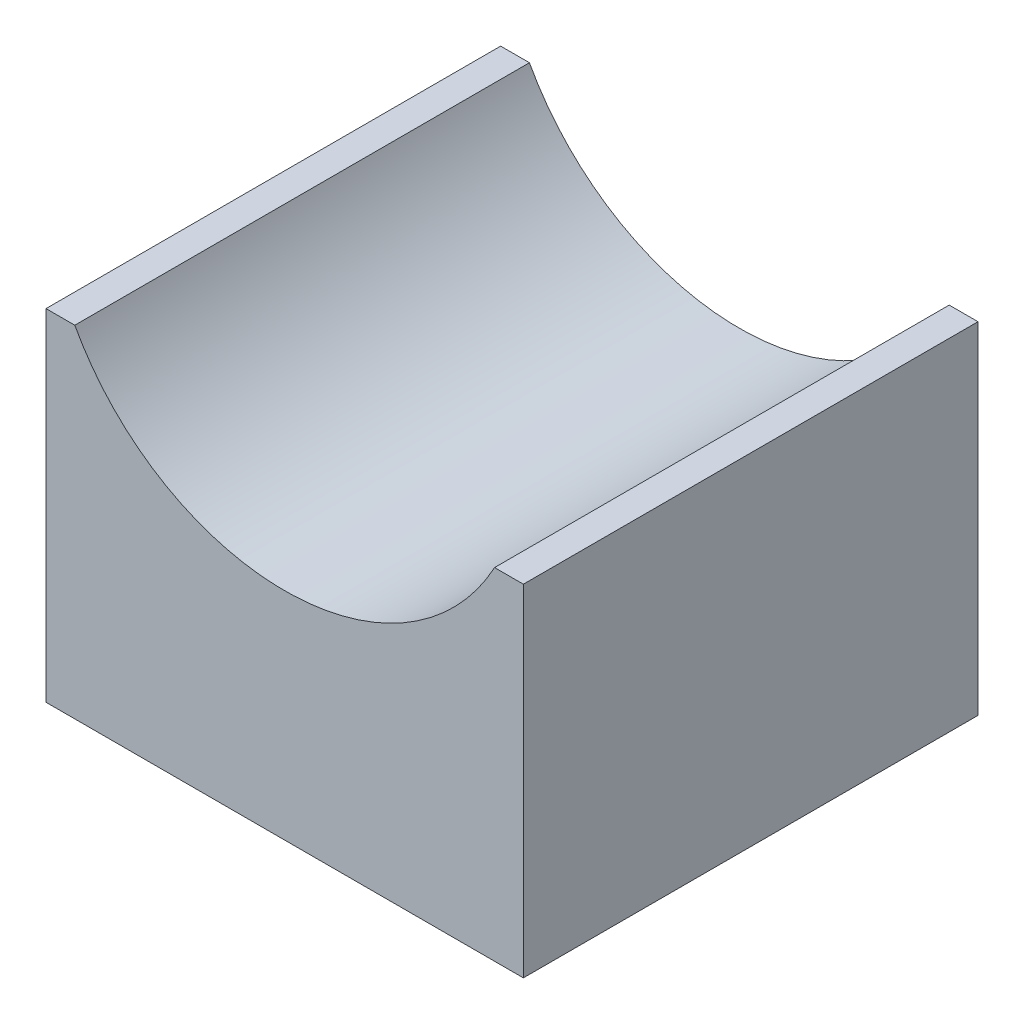
ISO-10303-21;
HEADER;
FILE_DESCRIPTION(('STEP AP214'),'2;1');
FILE_NAME('part.step','',(''),(''),'','','');
FILE_SCHEMA(('AUTOMOTIVE_DESIGN { 1 0 10303 214 1 1 1 1 }'));
ENDSEC;
DATA;
#1=APPLICATION_CONTEXT('core data for automotive mechanical design processes');
#2=APPLICATION_PROTOCOL_DEFINITION('international standard','automotive_design',2000,#1);
#3=PRODUCT_CONTEXT('',#1,'mechanical');
#4=PRODUCT('Part','Part','',(#3));
#5=PRODUCT_RELATED_PRODUCT_CATEGORY('part','',(#4));
#6=PRODUCT_DEFINITION_FORMATION('','',#4);
#7=PRODUCT_DEFINITION_CONTEXT('part definition',#1,'design');
#8=PRODUCT_DEFINITION('design','',#6,#7);
#9=PRODUCT_DEFINITION_SHAPE('','',#8);
#10=(LENGTH_UNIT() NAMED_UNIT(*) SI_UNIT(.MILLI.,.METRE.));
#11=(NAMED_UNIT(*) PLANE_ANGLE_UNIT() SI_UNIT($,.RADIAN.));
#12=(NAMED_UNIT(*) SI_UNIT($,.STERADIAN.) SOLID_ANGLE_UNIT());
#13=UNCERTAINTY_MEASURE_WITH_UNIT(LENGTH_MEASURE(1.E-05),#10,'distance_accuracy_value','');
#14=(GEOMETRIC_REPRESENTATION_CONTEXT(3) GLOBAL_UNCERTAINTY_ASSIGNED_CONTEXT((#13)) GLOBAL_UNIT_ASSIGNED_CONTEXT((#10,
#11,#12)) REPRESENTATION_CONTEXT('',''));
#15=CARTESIAN_POINT('',(0.,0.,0.));
#16=DIRECTION('',(0.,0.,1.));
#17=DIRECTION('',(1.,0.,0.));
#18=AXIS2_PLACEMENT_3D('',#15,#16,#17);
#19=CARTESIAN_POINT('',(0.,20.,10.));
#20=DIRECTION('',(0.,0.,-1.));
#21=DIRECTION('',(-1.,0.,0.));
#22=AXIS2_PLACEMENT_3D('',#19,#20,#21);
#23=CYLINDRICAL_SURFACE('',#22,10.5);
#24=CARTESIAN_POINT('',(0.,20.,-10.));
#25=DIRECTION('',(0.,0.,-1.));
#26=DIRECTION('',(1.,0.,0.));
#27=AXIS2_PLACEMENT_3D('',#24,#25,#26);
#28=CIRCLE('',#27,10.5);
#29=CARTESIAN_POINT('',(9.23309265630969,15.,-10.));
#30=VERTEX_POINT('',#29);
#31=CARTESIAN_POINT('',(-9.23309265630969,15.,-10.));
#32=VERTEX_POINT('',#31);
#33=EDGE_CURVE('E122',#30,#32,#28,.T.);
#34=ORIENTED_EDGE('',*,*,#33,.T.);
#35=DIRECTION('',(0.,0.,-1.));
#36=VECTOR('',#35,1.);
#37=CARTESIAN_POINT('',(-9.23309265630969,15.,10.));
#38=LINE('',#37,#36);
#39=CARTESIAN_POINT('',(-9.23309265630969,15.,10.));
#40=VERTEX_POINT('',#39);
#41=EDGE_CURVE('E11',#40,#32,#38,.T.);
#42=ORIENTED_EDGE('',*,*,#41,.F.);
#43=CARTESIAN_POINT('',(0.,20.,10.));
#44=DIRECTION('',(0.,0.,-1.));
#45=DIRECTION('',(1.,0.,0.));
#46=AXIS2_PLACEMENT_3D('',#43,#44,#45);
#47=CIRCLE('',#46,10.5);
#48=CARTESIAN_POINT('',(9.23309265630969,15.,10.));
#49=VERTEX_POINT('',#48);
#50=EDGE_CURVE('E132',#49,#40,#47,.T.);
#51=ORIENTED_EDGE('',*,*,#50,.F.);
#52=DIRECTION('',(0.,0.,-1.));
#53=VECTOR('',#52,1.);
#54=CARTESIAN_POINT('',(9.23309265630969,15.,10.));
#55=LINE('',#54,#53);
#56=EDGE_CURVE('E118',#49,#30,#55,.T.);
#57=ORIENTED_EDGE('',*,*,#56,.T.);
#58=EDGE_LOOP('',(#34,#42,#51,#57));
#59=FACE_BOUND('',#58,.T.);
#60=ADVANCED_FACE('F38',(#59),#23,.F.);
#61=CARTESIAN_POINT('',(-10.5,15.,10.));
#62=DIRECTION('',(0.,-1.,0.));
#63=DIRECTION('',(0.,0.,-1.));
#64=AXIS2_PLACEMENT_3D('',#61,#62,#63);
#65=PLANE('',#64);
#66=DIRECTION('',(-1.,0.,0.));
#67=VECTOR('',#66,1.);
#68=CARTESIAN_POINT('',(-10.5,15.,-10.));
#69=LINE('',#68,#67);
#70=CARTESIAN_POINT('',(-10.5,15.,-10.));
#71=VERTEX_POINT('',#70);
#72=EDGE_CURVE('E125',#32,#71,#69,.T.);
#73=ORIENTED_EDGE('',*,*,#72,.T.);
#74=DIRECTION('',(0.,0.,-1.));
#75=VECTOR('',#74,1.);
#76=CARTESIAN_POINT('',(-10.5,15.,10.));
#77=LINE('',#76,#75);
#78=CARTESIAN_POINT('',(-10.5,15.,10.));
#79=VERTEX_POINT('',#78);
#80=EDGE_CURVE('E46',#79,#71,#77,.T.);
#81=ORIENTED_EDGE('',*,*,#80,.F.);
#82=DIRECTION('',(-1.,0.,0.));
#83=VECTOR('',#82,1.);
#84=CARTESIAN_POINT('',(-10.5,15.,10.));
#85=LINE('',#84,#83);
#86=EDGE_CURVE('E91',#40,#79,#85,.T.);
#87=ORIENTED_EDGE('',*,*,#86,.F.);
#88=ORIENTED_EDGE('',*,*,#41,.T.);
#89=EDGE_LOOP('',(#73,#81,#87,#88));
#90=FACE_BOUND('',#89,.T.);
#91=ADVANCED_FACE('F156',(#90),#65,.F.);
#92=CARTESIAN_POINT('',(-10.5,15.,10.));
#93=DIRECTION('',(1.,0.,0.));
#94=DIRECTION('',(0.,0.,-1.));
#95=AXIS2_PLACEMENT_3D('',#92,#93,#94);
#96=PLANE('',#95);
#97=DIRECTION('',(0.,-1.,0.));
#98=VECTOR('',#97,1.);
#99=CARTESIAN_POINT('',(-10.5,15.,-10.));
#100=LINE('',#99,#98);
#101=CARTESIAN_POINT('',(-10.5,0.,-10.));
#102=VERTEX_POINT('',#101);
#103=EDGE_CURVE('E127',#71,#102,#100,.T.);
#104=ORIENTED_EDGE('',*,*,#103,.T.);
#105=DIRECTION('',(0.,0.,-1.));
#106=VECTOR('',#105,1.);
#107=CARTESIAN_POINT('',(-10.5,0.,10.));
#108=LINE('',#107,#106);
#109=CARTESIAN_POINT('',(-10.5,0.,10.));
#110=VERTEX_POINT('',#109);
#111=EDGE_CURVE('E113',#110,#102,#108,.T.);
#112=ORIENTED_EDGE('',*,*,#111,.F.);
#113=DIRECTION('',(0.,-1.,0.));
#114=VECTOR('',#113,1.);
#115=CARTESIAN_POINT('',(-10.5,15.,10.));
#116=LINE('',#115,#114);
#117=EDGE_CURVE('E104',#79,#110,#116,.T.);
#118=ORIENTED_EDGE('',*,*,#117,.F.);
#119=ORIENTED_EDGE('',*,*,#80,.T.);
#120=EDGE_LOOP('',(#104,#112,#118,#119));
#121=FACE_BOUND('',#120,.T.);
#122=ADVANCED_FACE('F138',(#121),#96,.F.);
#123=CARTESIAN_POINT('',(-10.5,0.,10.));
#124=DIRECTION('',(0.,1.,0.));
#125=DIRECTION('',(0.,0.,1.));
#126=AXIS2_PLACEMENT_3D('',#123,#124,#125);
#127=PLANE('',#126);
#128=DIRECTION('',(1.,0.,0.));
#129=VECTOR('',#128,1.);
#130=CARTESIAN_POINT('',(-10.5,0.,-10.));
#131=LINE('',#130,#129);
#132=CARTESIAN_POINT('',(10.5,0.,-10.));
#133=VERTEX_POINT('',#132);
#134=EDGE_CURVE('E112',#102,#133,#131,.T.);
#135=ORIENTED_EDGE('',*,*,#134,.T.);
#136=DIRECTION('',(0.,0.,-1.));
#137=VECTOR('',#136,1.);
#138=CARTESIAN_POINT('',(10.5,0.,10.));
#139=LINE('',#138,#137);
#140=CARTESIAN_POINT('',(10.5,0.,10.));
#141=VERTEX_POINT('',#140);
#142=EDGE_CURVE('E109',#141,#133,#139,.T.);
#143=ORIENTED_EDGE('',*,*,#142,.F.);
#144=DIRECTION('',(1.,0.,0.));
#145=VECTOR('',#144,1.);
#146=CARTESIAN_POINT('',(-10.5,0.,10.));
#147=LINE('',#146,#145);
#148=EDGE_CURVE('E98',#110,#141,#147,.T.);
#149=ORIENTED_EDGE('',*,*,#148,.F.);
#150=ORIENTED_EDGE('',*,*,#111,.T.);
#151=EDGE_LOOP('',(#135,#143,#149,#150));
#152=FACE_BOUND('',#151,.T.);
#153=ADVANCED_FACE('F110',(#152),#127,.F.);
#154=CARTESIAN_POINT('',(10.5,0.,10.));
#155=DIRECTION('',(-1.,0.,0.));
#156=DIRECTION('',(0.,-1.,0.));
#157=AXIS2_PLACEMENT_3D('',#154,#155,#156);
#158=PLANE('',#157);
#159=DIRECTION('',(0.,1.,0.));
#160=VECTOR('',#159,1.);
#161=CARTESIAN_POINT('',(10.5,0.,-10.));
#162=LINE('',#161,#160);
#163=CARTESIAN_POINT('',(10.5,15.,-10.));
#164=VERTEX_POINT('',#163);
#165=EDGE_CURVE('E77',#133,#164,#162,.T.);
#166=ORIENTED_EDGE('',*,*,#165,.T.);
#167=DIRECTION('',(0.,0.,-1.));
#168=VECTOR('',#167,1.);
#169=CARTESIAN_POINT('',(10.5,15.,10.));
#170=LINE('',#169,#168);
#171=CARTESIAN_POINT('',(10.5,15.,10.));
#172=VERTEX_POINT('',#171);
#173=EDGE_CURVE('E114',#172,#164,#170,.T.);
#174=ORIENTED_EDGE('',*,*,#173,.F.);
#175=DIRECTION('',(0.,1.,0.));
#176=VECTOR('',#175,1.);
#177=CARTESIAN_POINT('',(10.5,0.,10.));
#178=LINE('',#177,#176);
#179=EDGE_CURVE('E102',#141,#172,#178,.T.);
#180=ORIENTED_EDGE('',*,*,#179,.F.);
#181=ORIENTED_EDGE('',*,*,#142,.T.);
#182=EDGE_LOOP('',(#166,#174,#180,#181));
#183=FACE_BOUND('',#182,.T.);
#184=ADVANCED_FACE('F116',(#183),#158,.F.);
#185=CARTESIAN_POINT('',(9.23309265630969,15.,10.));
#186=DIRECTION('',(0.,-1.,0.));
#187=DIRECTION('',(0.,0.,-1.));
#188=AXIS2_PLACEMENT_3D('',#185,#186,#187);
#189=PLANE('',#188);
#190=DIRECTION('',(-1.,0.,0.));
#191=VECTOR('',#190,1.);
#192=CARTESIAN_POINT('',(9.23309265630969,15.,-10.));
#193=LINE('',#192,#191);
#194=EDGE_CURVE('E83',#164,#30,#193,.T.);
#195=ORIENTED_EDGE('',*,*,#194,.T.);
#196=ORIENTED_EDGE('',*,*,#56,.F.);
#197=DIRECTION('',(-1.,0.,0.));
#198=VECTOR('',#197,1.);
#199=CARTESIAN_POINT('',(9.23309265630969,15.,10.));
#200=LINE('',#199,#198);
#201=EDGE_CURVE('E54',#172,#49,#200,.T.);
#202=ORIENTED_EDGE('',*,*,#201,.F.);
#203=ORIENTED_EDGE('',*,*,#173,.T.);
#204=EDGE_LOOP('',(#195,#196,#202,#203));
#205=FACE_BOUND('',#204,.T.);
#206=ADVANCED_FACE('F145',(#205),#189,.F.);
#207=CARTESIAN_POINT('',(0.,20.,10.));
#208=DIRECTION('',(0.,0.,1.));
#209=DIRECTION('',(1.,0.,0.));
#210=AXIS2_PLACEMENT_3D('',#207,#208,#209);
#211=PLANE('',#210);
#212=ORIENTED_EDGE('',*,*,#50,.T.);
#213=ORIENTED_EDGE('',*,*,#86,.T.);
#214=ORIENTED_EDGE('',*,*,#117,.T.);
#215=ORIENTED_EDGE('',*,*,#148,.T.);
#216=ORIENTED_EDGE('',*,*,#179,.T.);
#217=ORIENTED_EDGE('',*,*,#201,.T.);
#218=EDGE_LOOP('',(#212,#213,#214,#215,#216,#217));
#219=FACE_BOUND('',#218,.T.);
#220=ADVANCED_FACE('F100',(#219),#211,.T.);
#221=CARTESIAN_POINT('',(0.,20.,-10.));
#222=DIRECTION('',(0.,0.,1.));
#223=DIRECTION('',(1.,0.,0.));
#224=AXIS2_PLACEMENT_3D('',#221,#222,#223);
#225=PLANE('',#224);
#226=ORIENTED_EDGE('',*,*,#33,.F.);
#227=ORIENTED_EDGE('',*,*,#194,.F.);
#228=ORIENTED_EDGE('',*,*,#165,.F.);
#229=ORIENTED_EDGE('',*,*,#134,.F.);
#230=ORIENTED_EDGE('',*,*,#103,.F.);
#231=ORIENTED_EDGE('',*,*,#72,.F.);
#232=EDGE_LOOP('',(#226,#227,#228,#229,#230,#231));
#233=FACE_BOUND('',#232,.T.);
#234=ADVANCED_FACE('F141',(#233),#225,.F.);
#235=CLOSED_SHELL('',(#60,#91,#122,#153,#184,#206,#220,#234));
#236=MANIFOLD_SOLID_BREP('B2',#235);
#237=ADVANCED_BREP_SHAPE_REPRESENTATION('',(#18,#236),#14);
#238=SHAPE_DEFINITION_REPRESENTATION(#9,#237);
ENDSEC;
END-ISO-10303-21;
